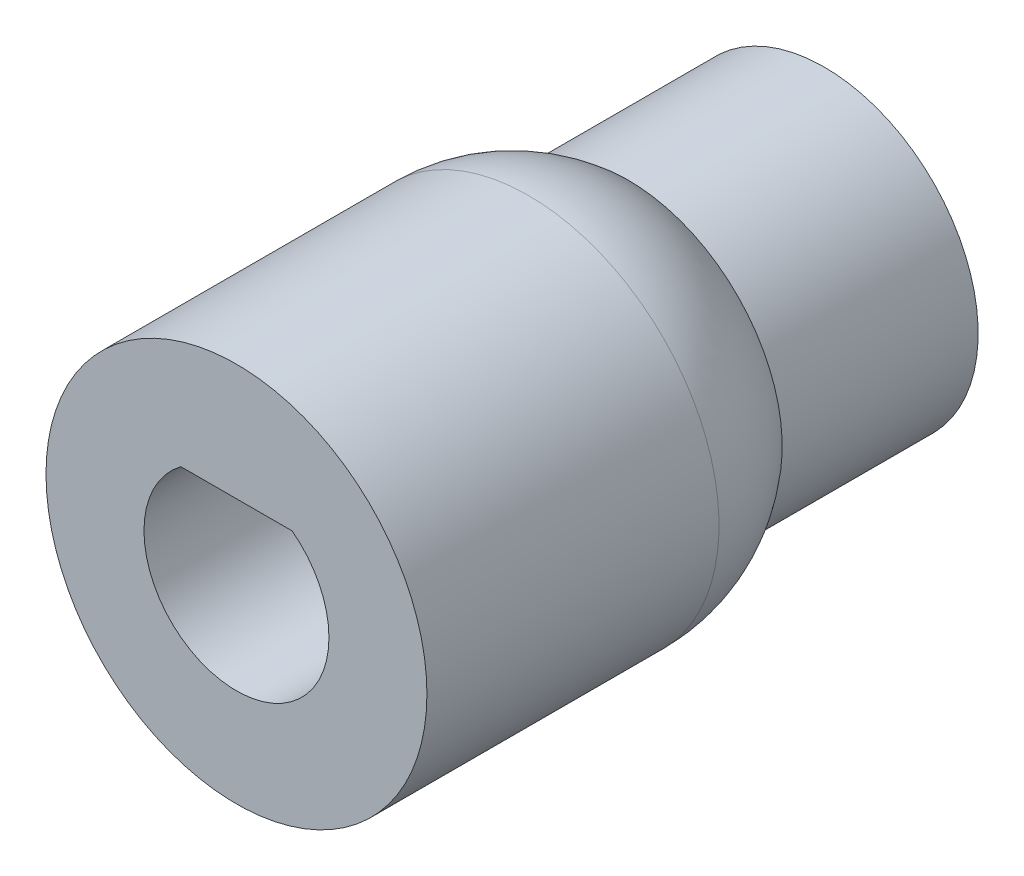
ISO-10303-21;
HEADER;
FILE_DESCRIPTION(('STEP AP214'),'2;1');
FILE_NAME('part.step','',(''),(''),'','','');
FILE_SCHEMA(('AUTOMOTIVE_DESIGN { 1 0 10303 214 1 1 1 1 }'));
ENDSEC;
DATA;
#1=APPLICATION_CONTEXT('core data for automotive mechanical design processes');
#2=APPLICATION_PROTOCOL_DEFINITION('international standard','automotive_design',2000,#1);
#3=PRODUCT_CONTEXT('',#1,'mechanical');
#4=PRODUCT('Part','Part','',(#3));
#5=PRODUCT_RELATED_PRODUCT_CATEGORY('part','',(#4));
#6=PRODUCT_DEFINITION_FORMATION('','',#4);
#7=PRODUCT_DEFINITION_CONTEXT('part definition',#1,'design');
#8=PRODUCT_DEFINITION('design','',#6,#7);
#9=PRODUCT_DEFINITION_SHAPE('','',#8);
#10=(LENGTH_UNIT() NAMED_UNIT(*) SI_UNIT(.MILLI.,.METRE.));
#11=(NAMED_UNIT(*) PLANE_ANGLE_UNIT() SI_UNIT($,.RADIAN.));
#12=(NAMED_UNIT(*) SI_UNIT($,.STERADIAN.) SOLID_ANGLE_UNIT());
#13=UNCERTAINTY_MEASURE_WITH_UNIT(LENGTH_MEASURE(1.E-05),#10,'distance_accuracy_value','');
#14=(GEOMETRIC_REPRESENTATION_CONTEXT(3) GLOBAL_UNCERTAINTY_ASSIGNED_CONTEXT((#13)) GLOBAL_UNIT_ASSIGNED_CONTEXT((#10,
#11,#12)) REPRESENTATION_CONTEXT('',''));
#15=CARTESIAN_POINT('',(0.,0.,0.));
#16=DIRECTION('',(0.,0.,1.));
#17=DIRECTION('',(1.,0.,0.));
#18=AXIS2_PLACEMENT_3D('',#15,#16,#17);
#19=CARTESIAN_POINT('',(0.,2.39394157823452,12.7));
#20=DIRECTION('',(0.,1.,0.));
#21=DIRECTION('',(0.,0.,1.));
#22=AXIS2_PLACEMENT_3D('',#19,#20,#21);
#23=PLANE('',#22);
#24=DIRECTION('',(1.,0.,0.));
#25=VECTOR('',#24,1.);
#26=CARTESIAN_POINT('',(0.,2.39394157823452,0.));
#27=LINE('',#26,#25);
#28=CARTESIAN_POINT('',(-1.8034,2.39394157823452,0.));
#29=VERTEX_POINT('',#28);
#30=CARTESIAN_POINT('',(1.8034,2.39394157823452,0.));
#31=VERTEX_POINT('',#30);
#32=EDGE_CURVE('E60',#29,#31,#27,.T.);
#33=ORIENTED_EDGE('',*,*,#32,.T.);
#34=DIRECTION('',(0.,0.,-1.));
#35=VECTOR('',#34,1.);
#36=CARTESIAN_POINT('',(1.8034,2.39394157823452,12.7));
#37=LINE('',#36,#35);
#38=CARTESIAN_POINT('',(1.8034,2.39394157823452,12.7));
#39=VERTEX_POINT('',#38);
#40=EDGE_CURVE('E64',#39,#31,#37,.T.);
#41=ORIENTED_EDGE('',*,*,#40,.F.);
#42=DIRECTION('',(1.,0.,0.));
#43=VECTOR('',#42,1.);
#44=CARTESIAN_POINT('',(0.,2.39394157823452,12.7));
#45=LINE('',#44,#43);
#46=CARTESIAN_POINT('',(-1.8034,2.39394157823452,12.7));
#47=VERTEX_POINT('',#46);
#48=EDGE_CURVE('E62',#47,#39,#45,.T.);
#49=ORIENTED_EDGE('',*,*,#48,.F.);
#50=DIRECTION('',(0.,0.,-1.));
#51=VECTOR('',#50,1.);
#52=CARTESIAN_POINT('',(-1.8034,2.39394157823452,12.7));
#53=LINE('',#52,#51);
#54=EDGE_CURVE('E50',#47,#29,#53,.T.);
#55=ORIENTED_EDGE('',*,*,#54,.T.);
#56=EDGE_LOOP('',(#33,#41,#49,#55));
#57=FACE_BOUND('',#56,.T.);
#58=ADVANCED_FACE('F34',(#57),#23,.F.);
#59=CARTESIAN_POINT('',(0.,0.,12.7));
#60=DIRECTION('',(0.,0.,-1.));
#61=DIRECTION('',(-1.,0.,0.));
#62=AXIS2_PLACEMENT_3D('',#59,#60,#61);
#63=CYLINDRICAL_SURFACE('',#62,2.9972);
#64=CARTESIAN_POINT('',(0.,0.,0.));
#65=DIRECTION('',(0.,0.,1.));
#66=DIRECTION('',(1.,0.,0.));
#67=AXIS2_PLACEMENT_3D('',#64,#65,#66);
#68=CIRCLE('',#67,2.9972);
#69=EDGE_CURVE('E68',#29,#31,#68,.T.);
#70=ORIENTED_EDGE('',*,*,#69,.F.);
#71=ORIENTED_EDGE('',*,*,#54,.F.);
#72=CARTESIAN_POINT('',(0.,0.,12.7));
#73=DIRECTION('',(0.,0.,1.));
#74=DIRECTION('',(1.,0.,0.));
#75=AXIS2_PLACEMENT_3D('',#72,#73,#74);
#76=CIRCLE('',#75,2.9972);
#77=EDGE_CURVE('E87',#47,#39,#76,.T.);
#78=ORIENTED_EDGE('',*,*,#77,.T.);
#79=ORIENTED_EDGE('',*,*,#40,.T.);
#80=EDGE_LOOP('',(#70,#71,#78,#79));
#81=FACE_BOUND('',#80,.T.);
#82=ADVANCED_FACE('F69',(#81),#63,.F.);
#83=CARTESIAN_POINT('',(0.,0.,12.7));
#84=DIRECTION('',(0.,0.,-1.));
#85=DIRECTION('',(-1.,0.,0.));
#86=AXIS2_PLACEMENT_3D('',#83,#84,#85);
#87=CYLINDRICAL_SURFACE('',#86,6.1722);
#88=CARTESIAN_POINT('',(0.,0.,3.23458747910766));
#89=DIRECTION('',(0.,0.,-1.));
#90=DIRECTION('',(-1.,0.,0.));
#91=AXIS2_PLACEMENT_3D('',#88,#89,#90);
#92=CIRCLE('',#91,6.1722);
#93=CARTESIAN_POINT('',(-6.1722,0.,3.23458747910766));
#94=VERTEX_POINT('',#93);
#95=EDGE_CURVE('E11',#94,#94,#92,.F.);
#96=ORIENTED_EDGE('',*,*,#95,.T.);
#97=EDGE_LOOP('',(#96));
#98=FACE_BOUND('',#97,.T.);
#99=CARTESIAN_POINT('',(0.,0.,12.7));
#100=DIRECTION('',(0.,0.,1.));
#101=DIRECTION('',(1.,0.,0.));
#102=AXIS2_PLACEMENT_3D('',#99,#100,#101);
#103=CIRCLE('',#102,6.1722);
#104=CARTESIAN_POINT('',(6.1722,0.,12.7));
#105=VERTEX_POINT('',#104);
#106=EDGE_CURVE('E65',#105,#105,#103,.T.);
#107=ORIENTED_EDGE('',*,*,#106,.F.);
#108=EDGE_LOOP('',(#107));
#109=FACE_BOUND('',#108,.T.);
#110=ADVANCED_FACE('F93',(#98,#109),#87,.T.);
#111=CARTESIAN_POINT('',(0.,0.,12.7));
#112=DIRECTION('',(0.,0.,1.));
#113=DIRECTION('',(1.,0.,0.));
#114=AXIS2_PLACEMENT_3D('',#111,#112,#113);
#115=PLANE('',#114);
#116=ORIENTED_EDGE('',*,*,#48,.T.);
#117=ORIENTED_EDGE('',*,*,#77,.F.);
#118=EDGE_LOOP('',(#116,#117));
#119=FACE_BOUND('',#118,.T.);
#120=ORIENTED_EDGE('',*,*,#106,.T.);
#121=EDGE_LOOP('',(#120));
#122=FACE_BOUND('',#121,.T.);
#123=ADVANCED_FACE('F91',(#119,#122),#115,.T.);
#124=CARTESIAN_POINT('',(0.,0.,-6.35));
#125=DIRECTION('',(0.,0.,-1.));
#126=DIRECTION('',(-1.,0.,0.));
#127=AXIS2_PLACEMENT_3D('',#124,#125,#126);
#128=PLANE('',#127);
#129=CARTESIAN_POINT('',(0.,0.,-6.35));
#130=DIRECTION('',(0.,0.,-1.));
#131=DIRECTION('',(-1.,0.,0.));
#132=AXIS2_PLACEMENT_3D('',#129,#130,#131);
#133=CIRCLE('',#132,4.985);
#134=CARTESIAN_POINT('',(-4.985,0.,-6.35));
#135=VERTEX_POINT('',#134);
#136=EDGE_CURVE('E74',#135,#135,#133,.T.);
#137=ORIENTED_EDGE('',*,*,#136,.T.);
#138=EDGE_LOOP('',(#137));
#139=FACE_BOUND('',#138,.T.);
#140=CARTESIAN_POINT('',(0.,0.,-6.35));
#141=DIRECTION('',(0.,0.,-1.));
#142=DIRECTION('',(-1.,0.,0.));
#143=AXIS2_PLACEMENT_3D('',#140,#141,#142);
#144=CIRCLE('',#143,1.985);
#145=CARTESIAN_POINT('',(-1.985,0.,-6.35));
#146=VERTEX_POINT('',#145);
#147=EDGE_CURVE('E77',#146,#146,#144,.T.);
#148=ORIENTED_EDGE('',*,*,#147,.F.);
#149=EDGE_LOOP('',(#148));
#150=FACE_BOUND('',#149,.T.);
#151=ADVANCED_FACE('F101',(#139,#150),#128,.T.);
#152=CARTESIAN_POINT('',(0.,0.,0.));
#153=DIRECTION('',(0.,0.,-1.));
#154=DIRECTION('',(-1.,0.,0.));
#155=AXIS2_PLACEMENT_3D('',#152,#153,#154);
#156=PLANE('',#155);
#157=ORIENTED_EDGE('',*,*,#32,.F.);
#158=ORIENTED_EDGE('',*,*,#69,.T.);
#159=EDGE_LOOP('',(#157,#158));
#160=FACE_BOUND('',#159,.T.);
#161=CARTESIAN_POINT('',(0.,0.,0.));
#162=DIRECTION('',(0.,0.,-1.));
#163=DIRECTION('',(-1.,0.,0.));
#164=AXIS2_PLACEMENT_3D('',#161,#162,#163);
#165=CIRCLE('',#164,1.985);
#166=CARTESIAN_POINT('',(-1.985,0.,0.));
#167=VERTEX_POINT('',#166);
#168=EDGE_CURVE('E181',#167,#167,#165,.T.);
#169=ORIENTED_EDGE('',*,*,#168,.T.);
#170=EDGE_LOOP('',(#169));
#171=FACE_BOUND('',#170,.T.);
#172=ADVANCED_FACE('F72',(#160,#171),#156,.F.);
#173=CARTESIAN_POINT('',(0.,0.,-6.35));
#174=DIRECTION('',(0.,0.,1.));
#175=DIRECTION('',(1.,0.,0.));
#176=AXIS2_PLACEMENT_3D('',#173,#174,#175);
#177=CYLINDRICAL_SURFACE('',#176,4.985);
#178=ORIENTED_EDGE('',*,*,#136,.F.);
#179=EDGE_LOOP('',(#178));
#180=FACE_BOUND('',#179,.T.);
#181=CARTESIAN_POINT('',(0.,0.,0.));
#182=DIRECTION('',(0.,0.,-1.));
#183=DIRECTION('',(-1.,0.,0.));
#184=AXIS2_PLACEMENT_3D('',#181,#182,#183);
#185=CIRCLE('',#184,4.985);
#186=CARTESIAN_POINT('',(-4.985,0.,0.));
#187=VERTEX_POINT('',#186);
#188=EDGE_CURVE('E43',#187,#187,#185,.T.);
#189=ORIENTED_EDGE('',*,*,#188,.T.);
#190=EDGE_LOOP('',(#189));
#191=FACE_BOUND('',#190,.T.);
#192=ADVANCED_FACE('F133',(#180,#191),#177,.T.);
#193=CARTESIAN_POINT('',(0.,0.,-6.35));
#194=DIRECTION('',(0.,0.,1.));
#195=DIRECTION('',(1.,0.,0.));
#196=AXIS2_PLACEMENT_3D('',#193,#194,#195);
#197=CYLINDRICAL_SURFACE('',#196,1.985);
#198=ORIENTED_EDGE('',*,*,#147,.T.);
#199=EDGE_LOOP('',(#198));
#200=FACE_BOUND('',#199,.T.);
#201=ORIENTED_EDGE('',*,*,#168,.F.);
#202=EDGE_LOOP('',(#201));
#203=FACE_BOUND('',#202,.T.);
#204=ADVANCED_FACE('F142',(#200,#203),#197,.F.);
#205=CARTESIAN_POINT('',(0.,0.,3.23458747910765));
#206=DIRECTION('',(0.,0.,-1.));
#207=DIRECTION('',(-1.,0.,0.));
#208=AXIS2_PLACEMENT_3D('',#205,#206,#207);
#209=DEGENERATE_TOROIDAL_SURFACE('',#208,1.1722,5.,.T.);
#210=ORIENTED_EDGE('',*,*,#188,.F.);
#211=EDGE_LOOP('',(#210));
#212=FACE_BOUND('',#211,.T.);
#213=ORIENTED_EDGE('',*,*,#95,.F.);
#214=EDGE_LOOP('',(#213));
#215=FACE_BOUND('',#214,.T.);
#216=ADVANCED_FACE('F36',(#212,#215),#209,.T.);
#217=CLOSED_SHELL('',(#58,#82,#110,#123,#151,#172,#192,#204,#216));
#218=MANIFOLD_SOLID_BREP('B2',#217);
#219=ADVANCED_BREP_SHAPE_REPRESENTATION('',(#18,#218),#14);
#220=SHAPE_DEFINITION_REPRESENTATION(#9,#219);
ENDSEC;
END-ISO-10303-21;
